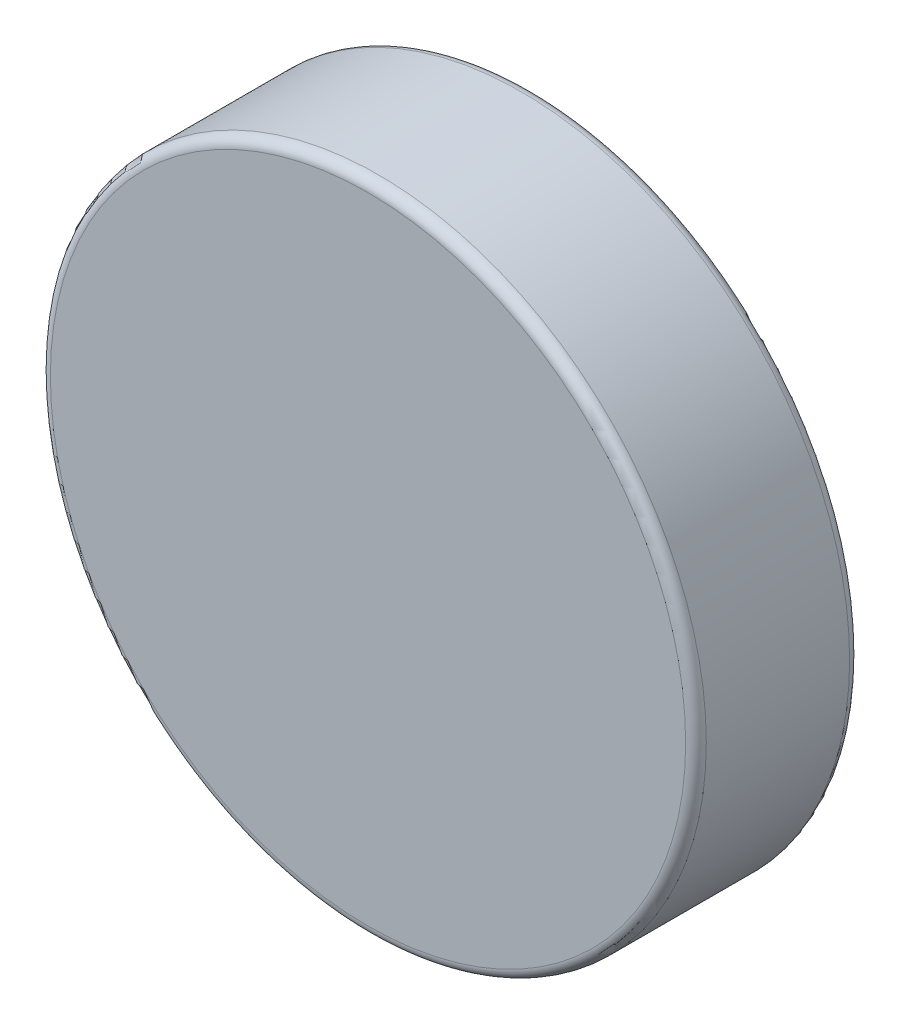
ISO-10303-21;
HEADER;
FILE_DESCRIPTION(('STEP AP214'),'2;1');
FILE_NAME('part.step','',(''),(''),'','','');
FILE_SCHEMA(('AUTOMOTIVE_DESIGN { 1 0 10303 214 1 1 1 1 }'));
ENDSEC;
DATA;
#1=APPLICATION_CONTEXT('core data for automotive mechanical design processes');
#2=APPLICATION_PROTOCOL_DEFINITION('international standard','automotive_design',2000,#1);
#3=PRODUCT_CONTEXT('',#1,'mechanical');
#4=PRODUCT('Part','Part','',(#3));
#5=PRODUCT_RELATED_PRODUCT_CATEGORY('part','',(#4));
#6=PRODUCT_DEFINITION_FORMATION('','',#4);
#7=PRODUCT_DEFINITION_CONTEXT('part definition',#1,'design');
#8=PRODUCT_DEFINITION('design','',#6,#7);
#9=PRODUCT_DEFINITION_SHAPE('','',#8);
#10=(LENGTH_UNIT() NAMED_UNIT(*) SI_UNIT(.MILLI.,.METRE.));
#11=(NAMED_UNIT(*) PLANE_ANGLE_UNIT() SI_UNIT($,.RADIAN.));
#12=(NAMED_UNIT(*) SI_UNIT($,.STERADIAN.) SOLID_ANGLE_UNIT());
#13=UNCERTAINTY_MEASURE_WITH_UNIT(LENGTH_MEASURE(1.E-05),#10,'distance_accuracy_value','');
#14=(GEOMETRIC_REPRESENTATION_CONTEXT(3) GLOBAL_UNCERTAINTY_ASSIGNED_CONTEXT((#13)) GLOBAL_UNIT_ASSIGNED_CONTEXT((#10,
#11,#12)) REPRESENTATION_CONTEXT('',''));
#15=CARTESIAN_POINT('',(0.,0.,0.));
#16=DIRECTION('',(0.,0.,1.));
#17=DIRECTION('',(1.,0.,0.));
#18=AXIS2_PLACEMENT_3D('',#15,#16,#17);
#19=CARTESIAN_POINT('',(0.,0.,1.5875));
#20=DIRECTION('',(0.,0.,-1.));
#21=DIRECTION('',(-1.,0.,0.));
#22=AXIS2_PLACEMENT_3D('',#19,#20,#21);
#23=CYLINDRICAL_SURFACE('',#22,3.175);
#24=CARTESIAN_POINT('',(0.,0.,0.1));
#25=DIRECTION('',(0.,0.,1.));
#26=DIRECTION('',(1.,0.,0.));
#27=AXIS2_PLACEMENT_3D('',#24,#25,#26);
#28=CIRCLE('',#27,3.175);
#29=CARTESIAN_POINT('',(3.175,0.,0.1));
#30=VERTEX_POINT('',#29);
#31=EDGE_CURVE('E44',#30,#30,#28,.T.);
#32=ORIENTED_EDGE('',*,*,#31,.T.);
#33=EDGE_LOOP('',(#32));
#34=FACE_BOUND('',#33,.T.);
#35=CARTESIAN_POINT('',(0.,0.,1.4875));
#36=DIRECTION('',(0.,0.,1.));
#37=DIRECTION('',(1.,0.,0.));
#38=AXIS2_PLACEMENT_3D('',#35,#36,#37);
#39=CIRCLE('',#38,3.175);
#40=CARTESIAN_POINT('',(3.175,0.,1.4875));
#41=VERTEX_POINT('',#40);
#42=EDGE_CURVE('E48',#41,#41,#39,.F.);
#43=ORIENTED_EDGE('',*,*,#42,.T.);
#44=EDGE_LOOP('',(#43));
#45=FACE_BOUND('',#44,.T.);
#46=ADVANCED_FACE('F33',(#34,#45),#23,.T.);
#47=CARTESIAN_POINT('',(0.,0.,1.5875));
#48=DIRECTION('',(0.,0.,1.));
#49=DIRECTION('',(1.,0.,0.));
#50=AXIS2_PLACEMENT_3D('',#47,#48,#49);
#51=PLANE('',#50);
#52=CARTESIAN_POINT('',(0.,0.,1.5875));
#53=DIRECTION('',(0.,0.,1.));
#54=DIRECTION('',(1.,0.,0.));
#55=AXIS2_PLACEMENT_3D('',#52,#53,#54);
#56=CIRCLE('',#55,3.075);
#57=CARTESIAN_POINT('',(3.075,0.,1.5875));
#58=VERTEX_POINT('',#57);
#59=EDGE_CURVE('E10',#58,#58,#56,.T.);
#60=ORIENTED_EDGE('',*,*,#59,.T.);
#61=EDGE_LOOP('',(#60));
#62=FACE_BOUND('',#61,.T.);
#63=ADVANCED_FACE('F64',(#62),#51,.T.);
#64=CARTESIAN_POINT('',(0.,0.,0.));
#65=DIRECTION('',(0.,0.,1.));
#66=DIRECTION('',(1.,0.,0.));
#67=AXIS2_PLACEMENT_3D('',#64,#65,#66);
#68=PLANE('',#67);
#69=CARTESIAN_POINT('',(0.,0.,0.));
#70=DIRECTION('',(0.,0.,1.));
#71=DIRECTION('',(1.,0.,0.));
#72=AXIS2_PLACEMENT_3D('',#69,#70,#71);
#73=CIRCLE('',#72,3.075);
#74=CARTESIAN_POINT('',(3.075,0.,0.));
#75=VERTEX_POINT('',#74);
#76=EDGE_CURVE('E40',#75,#75,#73,.F.);
#77=ORIENTED_EDGE('',*,*,#76,.T.);
#78=EDGE_LOOP('',(#77));
#79=FACE_BOUND('',#78,.T.);
#80=ADVANCED_FACE('F61',(#79),#68,.F.);
#81=CARTESIAN_POINT('',(0.,0.,0.1));
#82=DIRECTION('',(0.,0.,1.));
#83=DIRECTION('',(1.,0.,0.));
#84=AXIS2_PLACEMENT_3D('',#81,#82,#83);
#85=TOROIDAL_SURFACE('',#84,3.075,0.1);
#86=ORIENTED_EDGE('',*,*,#76,.F.);
#87=EDGE_LOOP('',(#86));
#88=FACE_BOUND('',#87,.T.);
#89=ORIENTED_EDGE('',*,*,#31,.F.);
#90=EDGE_LOOP('',(#89));
#91=FACE_BOUND('',#90,.T.);
#92=ADVANCED_FACE('F57',(#88,#91),#85,.T.);
#93=CARTESIAN_POINT('',(0.,0.,1.4875));
#94=DIRECTION('',(0.,0.,1.));
#95=DIRECTION('',(1.,0.,0.));
#96=AXIS2_PLACEMENT_3D('',#93,#94,#95);
#97=TOROIDAL_SURFACE('',#96,3.075,0.1);
#98=ORIENTED_EDGE('',*,*,#42,.F.);
#99=EDGE_LOOP('',(#98));
#100=FACE_BOUND('',#99,.T.);
#101=ORIENTED_EDGE('',*,*,#59,.F.);
#102=EDGE_LOOP('',(#101));
#103=FACE_BOUND('',#102,.T.);
#104=ADVANCED_FACE('F35',(#100,#103),#97,.T.);
#105=CLOSED_SHELL('',(#46,#63,#80,#92,#104));
#106=MANIFOLD_SOLID_BREP('B2',#105);
#107=ADVANCED_BREP_SHAPE_REPRESENTATION('',(#18,#106),#14);
#108=SHAPE_DEFINITION_REPRESENTATION(#9,#107);
ENDSEC;
END-ISO-10303-21;
